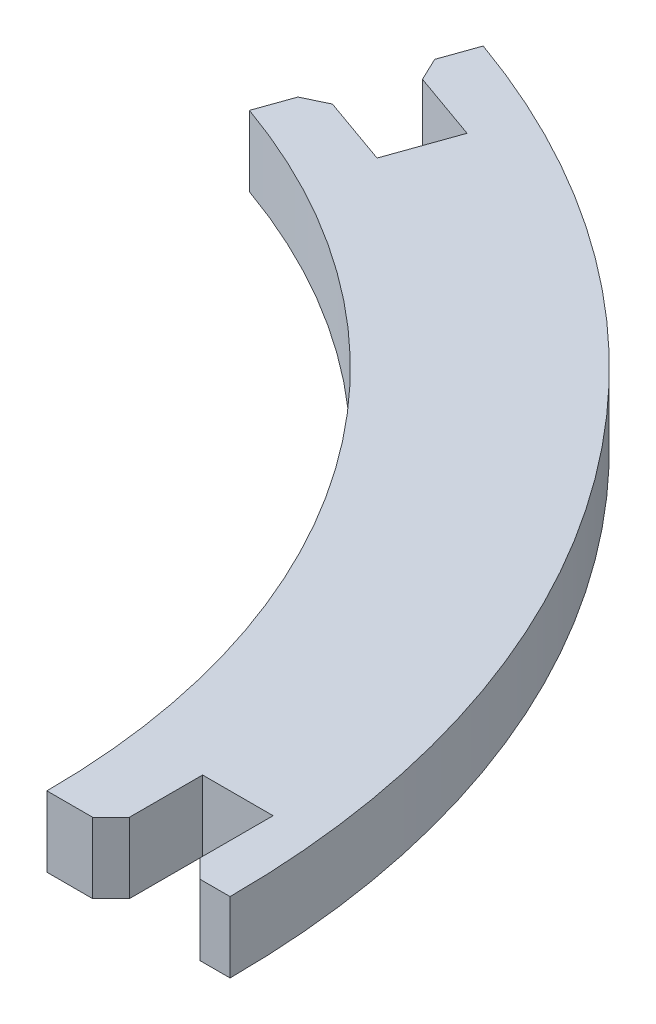
ISO-10303-21;
HEADER;
FILE_DESCRIPTION(('STEP AP214'),'2;1');
FILE_NAME('part.step','',(''),(''),'','','');
FILE_SCHEMA(('AUTOMOTIVE_DESIGN { 1 0 10303 214 1 1 1 1 }'));
ENDSEC;
DATA;
#1=APPLICATION_CONTEXT('core data for automotive mechanical design processes');
#2=APPLICATION_PROTOCOL_DEFINITION('international standard','automotive_design',2000,#1);
#3=PRODUCT_CONTEXT('',#1,'mechanical');
#4=PRODUCT('Part','Part','',(#3));
#5=PRODUCT_RELATED_PRODUCT_CATEGORY('part','',(#4));
#6=PRODUCT_DEFINITION_FORMATION('','',#4);
#7=PRODUCT_DEFINITION_CONTEXT('part definition',#1,'design');
#8=PRODUCT_DEFINITION('design','',#6,#7);
#9=PRODUCT_DEFINITION_SHAPE('','',#8);
#10=(LENGTH_UNIT() NAMED_UNIT(*) SI_UNIT(.MILLI.,.METRE.));
#11=(NAMED_UNIT(*) PLANE_ANGLE_UNIT() SI_UNIT($,.RADIAN.));
#12=(NAMED_UNIT(*) SI_UNIT($,.STERADIAN.) SOLID_ANGLE_UNIT());
#13=UNCERTAINTY_MEASURE_WITH_UNIT(LENGTH_MEASURE(1.E-05),#10,'distance_accuracy_value','');
#14=(GEOMETRIC_REPRESENTATION_CONTEXT(3) GLOBAL_UNCERTAINTY_ASSIGNED_CONTEXT((#13)) GLOBAL_UNIT_ASSIGNED_CONTEXT((#10,
#11,#12)) REPRESENTATION_CONTEXT('',''));
#15=CARTESIAN_POINT('',(0.,0.,0.));
#16=DIRECTION('',(0.,0.,1.));
#17=DIRECTION('',(1.,0.,0.));
#18=AXIS2_PLACEMENT_3D('',#15,#16,#17);
#19=CARTESIAN_POINT('',(-35.1875266501204,3.85,-46.9662814063563));
#20=DIRECTION('',(0.942641491092177,0.,0.333806859233775));
#21=DIRECTION('',(0.333806859233775,0.,-0.942641491092177));
#22=AXIS2_PLACEMENT_3D('',#19,#20,#21);
#23=PLANE('',#22);
#24=DIRECTION('',(-0.333806859233775,0.,0.942641491092177));
#25=VECTOR('',#24,1.);
#26=CARTESIAN_POINT('',(-35.1875266501204,0.,-46.9662814063563));
#27=LINE('',#26,#25);
#28=CARTESIAN_POINT('',(-35.1875266501204,0.,-46.9662814063563));
#29=VERTEX_POINT('',#28);
#30=CARTESIAN_POINT('',(-35.8801758830304,0.,-45.0103003123401));
#31=VERTEX_POINT('',#30);
#32=EDGE_CURVE('E197',#29,#31,#27,.T.);
#33=ORIENTED_EDGE('',*,*,#32,.T.);
#34=DIRECTION('',(0.,1.,0.));
#35=VECTOR('',#34,1.);
#36=CARTESIAN_POINT('',(-35.8801758830304,3.85,-45.0103003123401));
#37=LINE('',#36,#35);
#38=CARTESIAN_POINT('',(-35.8801758830304,3.85,-45.0103003123401));
#39=VERTEX_POINT('',#38);
#40=EDGE_CURVE('E261',#31,#39,#37,.T.);
#41=ORIENTED_EDGE('',*,*,#40,.T.);
#42=DIRECTION('',(-0.333806859233775,0.,0.942641491092177));
#43=VECTOR('',#42,1.);
#44=CARTESIAN_POINT('',(-35.1875266501204,3.85,-46.9662814063563));
#45=LINE('',#44,#43);
#46=CARTESIAN_POINT('',(-35.1875266501204,3.85,-46.9662814063563));
#47=VERTEX_POINT('',#46);
#48=EDGE_CURVE('E157',#47,#39,#45,.T.);
#49=ORIENTED_EDGE('',*,*,#48,.F.);
#50=DIRECTION('',(0.,-1.,0.));
#51=VECTOR('',#50,1.);
#52=CARTESIAN_POINT('',(-35.1875266501204,3.85,-46.9662814063563));
#53=LINE('',#52,#51);
#54=EDGE_CURVE('E196',#47,#29,#53,.T.);
#55=ORIENTED_EDGE('',*,*,#54,.T.);
#56=EDGE_LOOP('',(#33,#41,#49,#55));
#57=FACE_BOUND('',#56,.T.);
#58=ADVANCED_FACE('F33',(#57),#23,.F.);
#59=CARTESIAN_POINT('',(-36.2139827422642,3.85,-44.0676588212479));
#60=DIRECTION('',(0.333806859233768,0.,-0.94264149109218));
#61=DIRECTION('',(-0.94264149109218,0.,-0.333806859233768));
#62=AXIS2_PLACEMENT_3D('',#59,#60,#61);
#63=PLANE('',#62);
#64=DIRECTION('',(0.94264149109218,0.,0.333806859233768));
#65=VECTOR('',#64,1.);
#66=CARTESIAN_POINT('',(-36.2139827422642,3.85,-44.0676588212479));
#67=LINE('',#66,#65);
#68=CARTESIAN_POINT('',(-35.271341251172,3.85,-43.7338519620141));
#69=VERTEX_POINT('',#68);
#70=CARTESIAN_POINT('',(-31.5007752868033,3.85,-42.3986245250791));
#71=VERTEX_POINT('',#70);
#72=EDGE_CURVE('E144',#69,#71,#67,.T.);
#73=ORIENTED_EDGE('',*,*,#72,.F.);
#74=DIRECTION('',(0.,-1.,0.));
#75=VECTOR('',#74,1.);
#76=CARTESIAN_POINT('',(-35.271341251172,3.85,-43.7338519620141));
#77=LINE('',#76,#75);
#78=CARTESIAN_POINT('',(-35.271341251172,0.,-43.7338519620141));
#79=VERTEX_POINT('',#78);
#80=EDGE_CURVE('E259',#69,#79,#77,.T.);
#81=ORIENTED_EDGE('',*,*,#80,.T.);
#82=DIRECTION('',(0.94264149109218,0.,0.333806859233768));
#83=VECTOR('',#82,1.);
#84=CARTESIAN_POINT('',(-36.2139827422642,0.,-44.0676588212479));
#85=LINE('',#84,#83);
#86=CARTESIAN_POINT('',(-31.5007752868033,0.,-42.3986245250791));
#87=VERTEX_POINT('',#86);
#88=EDGE_CURVE('E163',#79,#87,#85,.T.);
#89=ORIENTED_EDGE('',*,*,#88,.T.);
#90=DIRECTION('',(0.,-1.,0.));
#91=VECTOR('',#90,1.);
#92=CARTESIAN_POINT('',(-31.5007752868033,3.85,-42.3986245250791));
#93=LINE('',#92,#91);
#94=EDGE_CURVE('E160',#71,#87,#93,.T.);
#95=ORIENTED_EDGE('',*,*,#94,.F.);
#96=EDGE_LOOP('',(#73,#81,#89,#95));
#97=FACE_BOUND('',#96,.T.);
#98=ADVANCED_FACE('F161',(#97),#63,.F.);
#99=CARTESIAN_POINT('',(-31.5007752868033,3.85,-42.3986245250791));
#100=DIRECTION('',(0.942641491092179,0.,0.33380685923377));
#101=DIRECTION('',(0.33380685923377,0.,-0.942641491092179));
#102=AXIS2_PLACEMENT_3D('',#99,#100,#101);
#103=PLANE('',#102);
#104=DIRECTION('',(-0.33380685923377,0.,0.942641491092179));
#105=VECTOR('',#104,1.);
#106=CARTESIAN_POINT('',(-31.5007752868033,0.,-42.3986245250791));
#107=LINE('',#106,#105);
#108=CARTESIAN_POINT('',(-32.7859316948533,0.,-38.7694547843742));
#109=VERTEX_POINT('',#108);
#110=EDGE_CURVE('E201',#87,#109,#107,.T.);
#111=ORIENTED_EDGE('',*,*,#110,.T.);
#112=DIRECTION('',(0.,-1.,0.));
#113=VECTOR('',#112,1.);
#114=CARTESIAN_POINT('',(-32.7859316948533,3.85,-38.7694547843742));
#115=LINE('',#114,#113);
#116=CARTESIAN_POINT('',(-32.7859316948533,3.85,-38.7694547843742));
#117=VERTEX_POINT('',#116);
#118=EDGE_CURVE('E168',#117,#109,#115,.T.);
#119=ORIENTED_EDGE('',*,*,#118,.F.);
#120=DIRECTION('',(-0.33380685923377,0.,0.942641491092179));
#121=VECTOR('',#120,1.);
#122=CARTESIAN_POINT('',(-31.5007752868033,3.85,-42.3986245250791));
#123=LINE('',#122,#121);
#124=EDGE_CURVE('E149',#71,#117,#123,.T.);
#125=ORIENTED_EDGE('',*,*,#124,.F.);
#126=ORIENTED_EDGE('',*,*,#94,.T.);
#127=EDGE_LOOP('',(#111,#119,#125,#126));
#128=FACE_BOUND('',#127,.T.);
#129=ADVANCED_FACE('F170',(#128),#103,.F.);
#130=CARTESIAN_POINT('',(-37.4991391503142,3.85,-40.438489080543));
#131=DIRECTION('',(0.333806859233767,0.,-0.94264149109218));
#132=DIRECTION('',(-0.94264149109218,0.,-0.333806859233767));
#133=AXIS2_PLACEMENT_3D('',#130,#131,#132);
#134=PLANE('',#133);
#135=DIRECTION('',(0.94264149109218,0.,0.333806859233767));
#136=VECTOR('',#135,1.);
#137=CARTESIAN_POINT('',(-37.4991391503142,0.,-40.438489080543));
#138=LINE('',#137,#136);
#139=CARTESIAN_POINT('',(-36.5564976592221,0.,-40.1046822213092));
#140=VERTEX_POINT('',#139);
#141=EDGE_CURVE('E203',#140,#109,#138,.T.);
#142=ORIENTED_EDGE('',*,*,#141,.F.);
#143=DIRECTION('',(0.,1.,0.));
#144=VECTOR('',#143,1.);
#145=CARTESIAN_POINT('',(-36.5564976592221,3.85,-40.1046822213092));
#146=LINE('',#145,#144);
#147=CARTESIAN_POINT('',(-36.5564976592221,3.85,-40.1046822213092));
#148=VERTEX_POINT('',#147);
#149=EDGE_CURVE('E251',#140,#148,#146,.T.);
#150=ORIENTED_EDGE('',*,*,#149,.T.);
#151=DIRECTION('',(0.94264149109218,0.,0.333806859233767));
#152=VECTOR('',#151,1.);
#153=CARTESIAN_POINT('',(-37.4991391503142,3.85,-40.438489080543));
#154=LINE('',#153,#152);
#155=EDGE_CURVE('E172',#148,#117,#154,.T.);
#156=ORIENTED_EDGE('',*,*,#155,.T.);
#157=ORIENTED_EDGE('',*,*,#118,.T.);
#158=EDGE_LOOP('',(#142,#150,#156,#157));
#159=FACE_BOUND('',#158,.T.);
#160=ADVANCED_FACE('F290',(#159),#134,.T.);
#161=CARTESIAN_POINT('',(-37.4991391503142,3.85,-40.438489080543));
#162=DIRECTION('',(0.942641491092181,0.,0.333806859233762));
#163=DIRECTION('',(0.333806859233762,0.,-0.942641491092181));
#164=AXIS2_PLACEMENT_3D('',#161,#162,#163);
#165=PLANE('',#164);
#166=DIRECTION('',(-0.333806859233763,0.,0.942641491092181));
#167=VECTOR('',#166,1.);
#168=CARTESIAN_POINT('',(-37.4991391503142,3.85,-40.438489080543));
#169=LINE('',#168,#167);
#170=CARTESIAN_POINT('',(-37.832946009548,3.85,-39.4958475894508));
#171=VERTEX_POINT('',#170);
#172=CARTESIAN_POINT('',(-38.5255952424581,3.85,-37.5398664954345));
#173=VERTEX_POINT('',#172);
#174=EDGE_CURVE('E174',#171,#173,#169,.T.);
#175=ORIENTED_EDGE('',*,*,#174,.F.);
#176=DIRECTION('',(0.,-1.,0.));
#177=VECTOR('',#176,1.);
#178=CARTESIAN_POINT('',(-37.832946009548,0.,-39.4958475894508));
#179=LINE('',#178,#177);
#180=CARTESIAN_POINT('',(-37.832946009548,0.,-39.4958475894508));
#181=VERTEX_POINT('',#180);
#182=EDGE_CURVE('E167',#171,#181,#179,.T.);
#183=ORIENTED_EDGE('',*,*,#182,.T.);
#184=DIRECTION('',(-0.333806859233763,0.,0.942641491092181));
#185=VECTOR('',#184,1.);
#186=CARTESIAN_POINT('',(-37.4991391503142,0.,-40.438489080543));
#187=LINE('',#186,#185);
#188=CARTESIAN_POINT('',(-38.5255952424581,0.,-37.5398664954345));
#189=VERTEX_POINT('',#188);
#190=EDGE_CURVE('E205',#181,#189,#187,.T.);
#191=ORIENTED_EDGE('',*,*,#190,.T.);
#192=DIRECTION('',(0.,-1.,0.));
#193=VECTOR('',#192,1.);
#194=CARTESIAN_POINT('',(-38.5255952424581,3.85,-37.5398664954345));
#195=LINE('',#194,#193);
#196=EDGE_CURVE('E237',#173,#189,#195,.T.);
#197=ORIENTED_EDGE('',*,*,#196,.F.);
#198=EDGE_LOOP('',(#175,#183,#191,#197));
#199=FACE_BOUND('',#198,.T.);
#200=ADVANCED_FACE('F297',(#199),#165,.F.);
#201=CARTESIAN_POINT('',(-51.8778696118088,3.85,0.16579314825264));
#202=DIRECTION('',(0.,-1.,0.));
#203=DIRECTION('',(0.,0.,-1.));
#204=AXIS2_PLACEMENT_3D('',#201,#202,#203);
#205=CYLINDRICAL_SURFACE('',#204,40.);
#206=CARTESIAN_POINT('',(-51.8778696118088,0.,0.16579314825264));
#207=DIRECTION('',(0.,-1.,0.));
#208=DIRECTION('',(0.,0.,-1.));
#209=AXIS2_PLACEMENT_3D('',#206,#207,#208);
#210=CIRCLE('',#209,40.);
#211=CARTESIAN_POINT('',(-11.8778696118088,0.,0.165793148252635));
#212=VERTEX_POINT('',#211);
#213=EDGE_CURVE('E207',#189,#212,#210,.T.);
#214=ORIENTED_EDGE('',*,*,#213,.T.);
#215=DIRECTION('',(0.,-1.,0.));
#216=VECTOR('',#215,1.);
#217=CARTESIAN_POINT('',(-11.8778696118088,3.85,0.165793148252635));
#218=LINE('',#217,#216);
#219=CARTESIAN_POINT('',(-11.8778696118088,3.85,0.165793148252635));
#220=VERTEX_POINT('',#219);
#221=EDGE_CURVE('E234',#220,#212,#218,.T.);
#222=ORIENTED_EDGE('',*,*,#221,.F.);
#223=CARTESIAN_POINT('',(-51.8778696118088,3.85,0.16579314825264));
#224=DIRECTION('',(0.,-1.,0.));
#225=DIRECTION('',(0.,0.,-1.));
#226=AXIS2_PLACEMENT_3D('',#223,#224,#225);
#227=CIRCLE('',#226,40.);
#228=EDGE_CURVE('E179',#173,#220,#227,.T.);
#229=ORIENTED_EDGE('',*,*,#228,.F.);
#230=ORIENTED_EDGE('',*,*,#196,.T.);
#231=EDGE_LOOP('',(#214,#222,#229,#230));
#232=FACE_BOUND('',#231,.T.);
#233=ADVANCED_FACE('F303',(#232),#205,.F.);
#234=CARTESIAN_POINT('',(-11.8778696118088,3.85,0.165793148252635));
#235=DIRECTION('',(0.,0.,-1.));
#236=DIRECTION('',(-1.,0.,0.));
#237=AXIS2_PLACEMENT_3D('',#234,#235,#236);
#238=PLANE('',#237);
#239=DIRECTION('',(1.,0.,0.));
#240=VECTOR('',#239,1.);
#241=CARTESIAN_POINT('',(-11.8778696118088,0.,0.165793148252635));
#242=LINE('',#241,#240);
#243=CARTESIAN_POINT('',(-9.37697360582112,0.,0.165793148252639));
#244=VERTEX_POINT('',#243);
#245=EDGE_CURVE('E209',#212,#244,#242,.T.);
#246=ORIENTED_EDGE('',*,*,#245,.T.);
#247=DIRECTION('',(0.,1.,0.));
#248=VECTOR('',#247,1.);
#249=CARTESIAN_POINT('',(-9.37697360582112,3.85,0.165793148252639));
#250=LINE('',#249,#248);
#251=CARTESIAN_POINT('',(-9.37697360582112,3.85,0.165793148252639));
#252=VERTEX_POINT('',#251);
#253=EDGE_CURVE('E266',#244,#252,#250,.T.);
#254=ORIENTED_EDGE('',*,*,#253,.T.);
#255=DIRECTION('',(1.,0.,0.));
#256=VECTOR('',#255,1.);
#257=CARTESIAN_POINT('',(-11.8778696118088,3.85,0.165793148252635));
#258=LINE('',#257,#256);
#259=EDGE_CURVE('E181',#220,#252,#258,.T.);
#260=ORIENTED_EDGE('',*,*,#259,.F.);
#261=ORIENTED_EDGE('',*,*,#221,.T.);
#262=EDGE_LOOP('',(#246,#254,#260,#261));
#263=FACE_BOUND('',#262,.T.);
#264=ADVANCED_FACE('F307',(#263),#238,.F.);
#265=CARTESIAN_POINT('',(-8.37697360582111,3.85,0.16579314825264));
#266=DIRECTION('',(-1.,0.,0.));
#267=DIRECTION('',(0.,0.,1.));
#268=AXIS2_PLACEMENT_3D('',#265,#266,#267);
#269=PLANE('',#268);
#270=DIRECTION('',(0.,0.,-1.));
#271=VECTOR('',#270,1.);
#272=CARTESIAN_POINT('',(-8.37697360582111,3.85,0.16579314825264));
#273=LINE('',#272,#271);
#274=CARTESIAN_POINT('',(-8.37697360582111,3.85,-0.834206851747361));
#275=VERTEX_POINT('',#274);
#276=CARTESIAN_POINT('',(-8.37697360582111,3.85,-4.83420685174736));
#277=VERTEX_POINT('',#276);
#278=EDGE_CURVE('E184',#275,#277,#273,.T.);
#279=ORIENTED_EDGE('',*,*,#278,.F.);
#280=DIRECTION('',(0.,-1.,0.));
#281=VECTOR('',#280,1.);
#282=CARTESIAN_POINT('',(-8.37697360582111,3.85,-0.834206851747361));
#283=LINE('',#282,#281);
#284=CARTESIAN_POINT('',(-8.37697360582111,0.,-0.834206851747361));
#285=VERTEX_POINT('',#284);
#286=EDGE_CURVE('E263',#275,#285,#283,.T.);
#287=ORIENTED_EDGE('',*,*,#286,.T.);
#288=DIRECTION('',(0.,0.,-1.));
#289=VECTOR('',#288,1.);
#290=CARTESIAN_POINT('',(-8.37697360582111,0.,0.16579314825264));
#291=LINE('',#290,#289);
#292=CARTESIAN_POINT('',(-8.37697360582111,0.,-4.83420685174736));
#293=VERTEX_POINT('',#292);
#294=EDGE_CURVE('E212',#285,#293,#291,.T.);
#295=ORIENTED_EDGE('',*,*,#294,.T.);
#296=DIRECTION('',(0.,-1.,0.));
#297=VECTOR('',#296,1.);
#298=CARTESIAN_POINT('',(-8.37697360582111,3.85,-4.83420685174736));
#299=LINE('',#298,#297);
#300=EDGE_CURVE('E231',#277,#293,#299,.T.);
#301=ORIENTED_EDGE('',*,*,#300,.F.);
#302=EDGE_LOOP('',(#279,#287,#295,#301));
#303=FACE_BOUND('',#302,.T.);
#304=ADVANCED_FACE('F316',(#303),#269,.F.);
#305=CARTESIAN_POINT('',(-8.37697360582111,3.85,-4.83420685174736));
#306=DIRECTION('',(0.,0.,-1.));
#307=DIRECTION('',(-1.,0.,0.));
#308=AXIS2_PLACEMENT_3D('',#305,#306,#307);
#309=PLANE('',#308);
#310=DIRECTION('',(1.,0.,0.));
#311=VECTOR('',#310,1.);
#312=CARTESIAN_POINT('',(-8.37697360582111,0.,-4.83420685174736));
#313=LINE('',#312,#311);
#314=CARTESIAN_POINT('',(-4.52697360582111,0.,-4.83420685174736));
#315=VERTEX_POINT('',#314);
#316=EDGE_CURVE('E214',#293,#315,#313,.T.);
#317=ORIENTED_EDGE('',*,*,#316,.T.);
#318=DIRECTION('',(0.,-1.,0.));
#319=VECTOR('',#318,1.);
#320=CARTESIAN_POINT('',(-4.52697360582111,3.85,-4.83420685174736));
#321=LINE('',#320,#319);
#322=CARTESIAN_POINT('',(-4.52697360582111,3.85,-4.83420685174736));
#323=VERTEX_POINT('',#322);
#324=EDGE_CURVE('E228',#323,#315,#321,.T.);
#325=ORIENTED_EDGE('',*,*,#324,.F.);
#326=DIRECTION('',(1.,0.,0.));
#327=VECTOR('',#326,1.);
#328=CARTESIAN_POINT('',(-8.37697360582111,3.85,-4.83420685174736));
#329=LINE('',#328,#327);
#330=EDGE_CURVE('E186',#277,#323,#329,.T.);
#331=ORIENTED_EDGE('',*,*,#330,.F.);
#332=ORIENTED_EDGE('',*,*,#300,.T.);
#333=EDGE_LOOP('',(#317,#325,#331,#332));
#334=FACE_BOUND('',#333,.T.);
#335=ADVANCED_FACE('F321',(#334),#309,.F.);
#336=CARTESIAN_POINT('',(-4.52697360582111,3.85,0.16579314825264));
#337=DIRECTION('',(-1.,0.,0.));
#338=DIRECTION('',(0.,0.,1.));
#339=AXIS2_PLACEMENT_3D('',#336,#337,#338);
#340=PLANE('',#339);
#341=DIRECTION('',(0.,0.,-1.));
#342=VECTOR('',#341,1.);
#343=CARTESIAN_POINT('',(-4.52697360582111,0.,0.16579314825264));
#344=LINE('',#343,#342);
#345=CARTESIAN_POINT('',(-4.52697360582111,0.,-0.834206851747361));
#346=VERTEX_POINT('',#345);
#347=EDGE_CURVE('E217',#346,#315,#344,.T.);
#348=ORIENTED_EDGE('',*,*,#347,.F.);
#349=DIRECTION('',(0.,1.,0.));
#350=VECTOR('',#349,1.);
#351=CARTESIAN_POINT('',(-4.52697360582111,3.85,-0.834206851747361));
#352=LINE('',#351,#350);
#353=CARTESIAN_POINT('',(-4.52697360582111,3.85,-0.834206851747361));
#354=VERTEX_POINT('',#353);
#355=EDGE_CURVE('E11',#346,#354,#352,.T.);
#356=ORIENTED_EDGE('',*,*,#355,.T.);
#357=DIRECTION('',(0.,0.,-1.));
#358=VECTOR('',#357,1.);
#359=CARTESIAN_POINT('',(-4.52697360582111,3.85,0.16579314825264));
#360=LINE('',#359,#358);
#361=EDGE_CURVE('E189',#354,#323,#360,.T.);
#362=ORIENTED_EDGE('',*,*,#361,.T.);
#363=ORIENTED_EDGE('',*,*,#324,.T.);
#364=EDGE_LOOP('',(#348,#356,#362,#363));
#365=FACE_BOUND('',#364,.T.);
#366=ADVANCED_FACE('F388',(#365),#340,.T.);
#367=CARTESIAN_POINT('',(-4.52697360582111,3.85,0.16579314825264));
#368=DIRECTION('',(0.,0.,-1.));
#369=DIRECTION('',(-1.,0.,0.));
#370=AXIS2_PLACEMENT_3D('',#367,#368,#369);
#371=PLANE('',#370);
#372=DIRECTION('',(1.,0.,0.));
#373=VECTOR('',#372,1.);
#374=CARTESIAN_POINT('',(-4.52697360582111,3.85,0.16579314825264));
#375=LINE('',#374,#373);
#376=CARTESIAN_POINT('',(-3.52697360582112,3.85,0.165793148252638));
#377=VERTEX_POINT('',#376);
#378=CARTESIAN_POINT('',(-1.87786961180877,3.85,0.165793148252637));
#379=VERTEX_POINT('',#378);
#380=EDGE_CURVE('E191',#377,#379,#375,.T.);
#381=ORIENTED_EDGE('',*,*,#380,.F.);
#382=DIRECTION('',(0.,-1.,0.));
#383=VECTOR('',#382,1.);
#384=CARTESIAN_POINT('',(-3.52697360582112,0.,0.165793148252638));
#385=LINE('',#384,#383);
#386=CARTESIAN_POINT('',(-3.52697360582112,0.,0.165793148252638));
#387=VERTEX_POINT('',#386);
#388=EDGE_CURVE('E41',#377,#387,#385,.T.);
#389=ORIENTED_EDGE('',*,*,#388,.T.);
#390=DIRECTION('',(1.,0.,0.));
#391=VECTOR('',#390,1.);
#392=CARTESIAN_POINT('',(-4.52697360582111,0.,0.16579314825264));
#393=LINE('',#392,#391);
#394=CARTESIAN_POINT('',(-1.87786961180877,0.,0.165793148252637));
#395=VERTEX_POINT('',#394);
#396=EDGE_CURVE('E219',#387,#395,#393,.T.);
#397=ORIENTED_EDGE('',*,*,#396,.T.);
#398=DIRECTION('',(0.,-1.,0.));
#399=VECTOR('',#398,1.);
#400=CARTESIAN_POINT('',(-1.87786961180877,3.85,0.165793148252637));
#401=LINE('',#400,#399);
#402=EDGE_CURVE('E225',#379,#395,#401,.T.);
#403=ORIENTED_EDGE('',*,*,#402,.F.);
#404=EDGE_LOOP('',(#381,#389,#397,#403));
#405=FACE_BOUND('',#404,.T.);
#406=ADVANCED_FACE('F271',(#405),#371,.F.);
#407=CARTESIAN_POINT('',(-51.8778696118088,3.85,0.16579314825264));
#408=DIRECTION('',(0.,-1.,0.));
#409=DIRECTION('',(0.,0.,-1.));
#410=AXIS2_PLACEMENT_3D('',#407,#408,#409);
#411=CYLINDRICAL_SURFACE('',#410,50.);
#412=CARTESIAN_POINT('',(-51.8778696118088,0.,0.16579314825264));
#413=DIRECTION('',(0.,-1.,0.));
#414=DIRECTION('',(0.,0.,-1.));
#415=AXIS2_PLACEMENT_3D('',#412,#413,#414);
#416=CIRCLE('',#415,50.);
#417=EDGE_CURVE('E221',#29,#395,#416,.T.);
#418=ORIENTED_EDGE('',*,*,#417,.F.);
#419=ORIENTED_EDGE('',*,*,#54,.F.);
#420=CARTESIAN_POINT('',(-51.8778696118088,3.85,0.16579314825264));
#421=DIRECTION('',(0.,-1.,0.));
#422=DIRECTION('',(0.,0.,-1.));
#423=AXIS2_PLACEMENT_3D('',#420,#421,#422);
#424=CIRCLE('',#423,50.);
#425=EDGE_CURVE('E193',#47,#379,#424,.T.);
#426=ORIENTED_EDGE('',*,*,#425,.T.);
#427=ORIENTED_EDGE('',*,*,#402,.T.);
#428=EDGE_LOOP('',(#418,#419,#426,#427));
#429=FACE_BOUND('',#428,.T.);
#430=ADVANCED_FACE('F280',(#429),#411,.T.);
#431=CARTESIAN_POINT('',(-51.8778696118088,3.85,0.16579314825264));
#432=DIRECTION('',(0.,-1.,0.));
#433=DIRECTION('',(0.,0.,-1.));
#434=AXIS2_PLACEMENT_3D('',#431,#432,#433);
#435=PLANE('',#434);
#436=ORIENTED_EDGE('',*,*,#155,.F.);
#437=DIRECTION('',(-0.90258528434986,0.,0.430511096808296));
#438=VECTOR('',#437,1.);
#439=CARTESIAN_POINT('',(-37.832946009548,3.85,-39.4958475894508));
#440=LINE('',#439,#438);
#441=EDGE_CURVE('E257',#148,#171,#440,.T.);
#442=ORIENTED_EDGE('',*,*,#441,.T.);
#443=ORIENTED_EDGE('',*,*,#174,.T.);
#444=ORIENTED_EDGE('',*,*,#228,.T.);
#445=ORIENTED_EDGE('',*,*,#259,.T.);
#446=DIRECTION('',(-0.70710678118655,0.,0.707106781186545));
#447=VECTOR('',#446,1.);
#448=CARTESIAN_POINT('',(-8.37697360582111,3.85,-0.834206851747361));
#449=LINE('',#448,#447);
#450=EDGE_CURVE('E254',#252,#275,#449,.F.);
#451=ORIENTED_EDGE('',*,*,#450,.T.);
#452=ORIENTED_EDGE('',*,*,#278,.T.);
#453=ORIENTED_EDGE('',*,*,#330,.T.);
#454=ORIENTED_EDGE('',*,*,#361,.F.);
#455=DIRECTION('',(0.707106781186545,0.,0.70710678118655));
#456=VECTOR('',#455,1.);
#457=CARTESIAN_POINT('',(-3.52697360582112,3.85,0.165793148252638));
#458=LINE('',#457,#456);
#459=EDGE_CURVE('E48',#354,#377,#458,.T.);
#460=ORIENTED_EDGE('',*,*,#459,.T.);
#461=ORIENTED_EDGE('',*,*,#380,.T.);
#462=ORIENTED_EDGE('',*,*,#425,.F.);
#463=ORIENTED_EDGE('',*,*,#48,.T.);
#464=DIRECTION('',(-0.430511096808288,0.,-0.902585284349864));
#465=VECTOR('',#464,1.);
#466=CARTESIAN_POINT('',(-35.271341251172,3.85,-43.7338519620141));
#467=LINE('',#466,#465);
#468=EDGE_CURVE('E153',#39,#69,#467,.F.);
#469=ORIENTED_EDGE('',*,*,#468,.T.);
#470=ORIENTED_EDGE('',*,*,#72,.T.);
#471=ORIENTED_EDGE('',*,*,#124,.T.);
#472=EDGE_LOOP('',(#436,#442,#443,#444,#445,#451,#452,#453,#454,#460,#461,#462,#463,#469,#470,#471));
#473=FACE_BOUND('',#472,.T.);
#474=ADVANCED_FACE('F147',(#473),#435,.F.);
#475=CARTESIAN_POINT('',(-51.8778696118088,0.,0.16579314825264));
#476=DIRECTION('',(0.,-1.,0.));
#477=DIRECTION('',(0.,0.,-1.));
#478=AXIS2_PLACEMENT_3D('',#475,#476,#477);
#479=PLANE('',#478);
#480=ORIENTED_EDGE('',*,*,#190,.F.);
#481=DIRECTION('',(0.90258528434986,0.,-0.430511096808296));
#482=VECTOR('',#481,1.);
#483=CARTESIAN_POINT('',(-64.6862281795301,0.,-26.6874890217296));
#484=LINE('',#483,#482);
#485=EDGE_CURVE('E249',#181,#140,#484,.T.);
#486=ORIENTED_EDGE('',*,*,#485,.T.);
#487=ORIENTED_EDGE('',*,*,#141,.T.);
#488=ORIENTED_EDGE('',*,*,#110,.F.);
#489=ORIENTED_EDGE('',*,*,#88,.F.);
#490=DIRECTION('',(0.430511096808288,0.,0.902585284349864));
#491=VECTOR('',#490,1.);
#492=CARTESIAN_POINT('',(-21.2909760171234,0.,-14.4234067176541));
#493=LINE('',#492,#491);
#494=EDGE_CURVE('E247',#79,#31,#493,.F.);
#495=ORIENTED_EDGE('',*,*,#494,.T.);
#496=ORIENTED_EDGE('',*,*,#32,.F.);
#497=ORIENTED_EDGE('',*,*,#417,.T.);
#498=ORIENTED_EDGE('',*,*,#396,.F.);
#499=DIRECTION('',(-0.707106781186545,0.,-0.70710678118655));
#500=VECTOR('',#499,1.);
#501=CARTESIAN_POINT('',(-27.7024216088148,0.,-24.0096548547412));
#502=LINE('',#501,#500);
#503=EDGE_CURVE('E243',#387,#346,#502,.T.);
#504=ORIENTED_EDGE('',*,*,#503,.T.);
#505=ORIENTED_EDGE('',*,*,#347,.T.);
#506=ORIENTED_EDGE('',*,*,#316,.F.);
#507=ORIENTED_EDGE('',*,*,#294,.F.);
#508=DIRECTION('',(0.70710678118655,0.,-0.707106781186545));
#509=VECTOR('',#508,1.);
#510=CARTESIAN_POINT('',(-30.6274216088151,0.,21.4162411512465));
#511=LINE('',#510,#509);
#512=EDGE_CURVE('E245',#285,#244,#511,.F.);
#513=ORIENTED_EDGE('',*,*,#512,.T.);
#514=ORIENTED_EDGE('',*,*,#245,.F.);
#515=ORIENTED_EDGE('',*,*,#213,.F.);
#516=EDGE_LOOP('',(#480,#486,#487,#488,#489,#495,#496,#497,#498,#504,#505,#506,#507,#513,#514,#515));
#517=FACE_BOUND('',#516,.T.);
#518=ADVANCED_FACE('F276',(#517),#479,.T.);
#519=CARTESIAN_POINT('',(-37.832946009548,3.85,-39.4958475894508));
#520=DIRECTION('',(-0.430511096808296,0.,-0.90258528434986));
#521=DIRECTION('',(0.,1.,0.));
#522=AXIS2_PLACEMENT_3D('',#519,#520,#521);
#523=PLANE('',#522);
#524=ORIENTED_EDGE('',*,*,#441,.F.);
#525=ORIENTED_EDGE('',*,*,#149,.F.);
#526=ORIENTED_EDGE('',*,*,#485,.F.);
#527=ORIENTED_EDGE('',*,*,#182,.F.);
#528=EDGE_LOOP('',(#524,#525,#526,#527));
#529=FACE_BOUND('',#528,.T.);
#530=ADVANCED_FACE('F295',(#529),#523,.T.);
#531=CARTESIAN_POINT('',(-35.271341251172,3.85,-43.7338519620141));
#532=DIRECTION('',(0.902585284349864,0.,-0.430511096808288));
#533=DIRECTION('',(0.,-1.,0.));
#534=AXIS2_PLACEMENT_3D('',#531,#532,#533);
#535=PLANE('',#534);
#536=ORIENTED_EDGE('',*,*,#468,.F.);
#537=ORIENTED_EDGE('',*,*,#40,.F.);
#538=ORIENTED_EDGE('',*,*,#494,.F.);
#539=ORIENTED_EDGE('',*,*,#80,.F.);
#540=EDGE_LOOP('',(#536,#537,#538,#539));
#541=FACE_BOUND('',#540,.T.);
#542=ADVANCED_FACE('F286',(#541),#535,.F.);
#543=CARTESIAN_POINT('',(-8.37697360582111,3.85,-0.834206851747361));
#544=DIRECTION('',(-0.707106781186545,0.,-0.70710678118655));
#545=DIRECTION('',(0.,-1.,0.));
#546=AXIS2_PLACEMENT_3D('',#543,#544,#545);
#547=PLANE('',#546);
#548=ORIENTED_EDGE('',*,*,#450,.F.);
#549=ORIENTED_EDGE('',*,*,#253,.F.);
#550=ORIENTED_EDGE('',*,*,#512,.F.);
#551=ORIENTED_EDGE('',*,*,#286,.F.);
#552=EDGE_LOOP('',(#548,#549,#550,#551));
#553=FACE_BOUND('',#552,.T.);
#554=ADVANCED_FACE('F313',(#553),#547,.F.);
#555=CARTESIAN_POINT('',(-3.52697360582112,3.85,0.165793148252638));
#556=DIRECTION('',(-0.70710678118655,0.,0.707106781186545));
#557=DIRECTION('',(0.,1.,0.));
#558=AXIS2_PLACEMENT_3D('',#555,#556,#557);
#559=PLANE('',#558);
#560=ORIENTED_EDGE('',*,*,#459,.F.);
#561=ORIENTED_EDGE('',*,*,#355,.F.);
#562=ORIENTED_EDGE('',*,*,#503,.F.);
#563=ORIENTED_EDGE('',*,*,#388,.F.);
#564=EDGE_LOOP('',(#560,#561,#562,#563));
#565=FACE_BOUND('',#564,.T.);
#566=ADVANCED_FACE('F35',(#565),#559,.T.);
#567=CLOSED_SHELL('',(#58,#98,#129,#160,#200,#233,#264,#304,#335,#366,#406,#430,#474,#518,#530,
#542,#554,#566));
#568=MANIFOLD_SOLID_BREP('B2',#567);
#569=ADVANCED_BREP_SHAPE_REPRESENTATION('',(#18,#568),#14);
#570=SHAPE_DEFINITION_REPRESENTATION(#9,#569);
ENDSEC;
END-ISO-10303-21;
